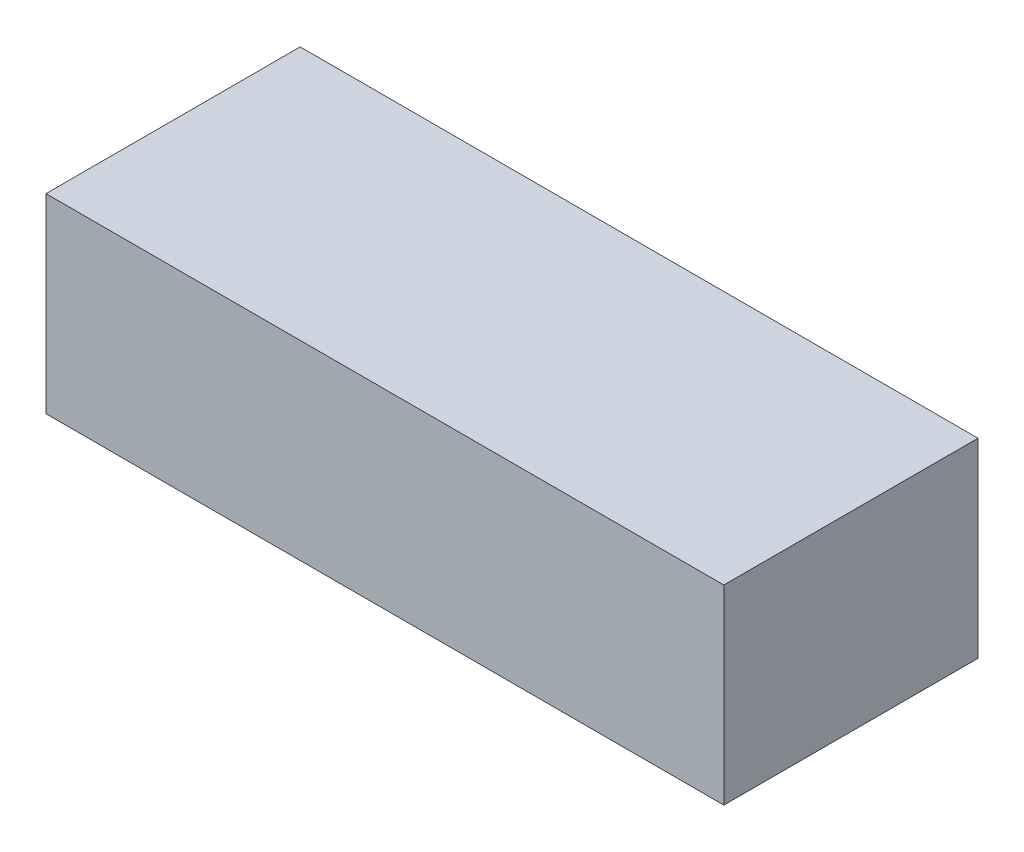
ISO-10303-21;
HEADER;
FILE_DESCRIPTION(('STEP AP214'),'2;1');
FILE_NAME('part.step','',(''),(''),'','','');
FILE_SCHEMA(('AUTOMOTIVE_DESIGN { 1 0 10303 214 1 1 1 1 }'));
ENDSEC;
DATA;
#1=APPLICATION_CONTEXT('core data for automotive mechanical design processes');
#2=APPLICATION_PROTOCOL_DEFINITION('international standard','automotive_design',2000,#1);
#3=PRODUCT_CONTEXT('',#1,'mechanical');
#4=PRODUCT('Part','Part','',(#3));
#5=PRODUCT_RELATED_PRODUCT_CATEGORY('part','',(#4));
#6=PRODUCT_DEFINITION_FORMATION('','',#4);
#7=PRODUCT_DEFINITION_CONTEXT('part definition',#1,'design');
#8=PRODUCT_DEFINITION('design','',#6,#7);
#9=PRODUCT_DEFINITION_SHAPE('','',#8);
#10=(LENGTH_UNIT() NAMED_UNIT(*) SI_UNIT(.MILLI.,.METRE.));
#11=(NAMED_UNIT(*) PLANE_ANGLE_UNIT() SI_UNIT($,.RADIAN.));
#12=(NAMED_UNIT(*) SI_UNIT($,.STERADIAN.) SOLID_ANGLE_UNIT());
#13=UNCERTAINTY_MEASURE_WITH_UNIT(LENGTH_MEASURE(1.E-05),#10,'distance_accuracy_value','');
#14=(GEOMETRIC_REPRESENTATION_CONTEXT(3) GLOBAL_UNCERTAINTY_ASSIGNED_CONTEXT((#13)) GLOBAL_UNIT_ASSIGNED_CONTEXT((#10,
#11,#12)) REPRESENTATION_CONTEXT('',''));
#15=CARTESIAN_POINT('',(0.,0.,0.));
#16=DIRECTION('',(0.,0.,1.));
#17=DIRECTION('',(1.,0.,0.));
#18=AXIS2_PLACEMENT_3D('',#15,#16,#17);
#19=CARTESIAN_POINT('',(0.,45.,60.));
#20=DIRECTION('',(1.,0.,0.));
#21=DIRECTION('',(0.,0.,-1.));
#22=AXIS2_PLACEMENT_3D('',#19,#20,#21);
#23=PLANE('',#22);
#24=DIRECTION('',(0.,0.,1.));
#25=VECTOR('',#24,1.);
#26=CARTESIAN_POINT('',(0.,0.,60.));
#27=LINE('',#26,#25);
#28=CARTESIAN_POINT('',(0.,0.,0.));
#29=VERTEX_POINT('',#28);
#30=CARTESIAN_POINT('',(0.,0.,60.));
#31=VERTEX_POINT('',#30);
#32=EDGE_CURVE('E99',#29,#31,#27,.T.);
#33=ORIENTED_EDGE('',*,*,#32,.T.);
#34=DIRECTION('',(0.,-1.,0.));
#35=VECTOR('',#34,1.);
#36=CARTESIAN_POINT('',(0.,45.,60.));
#37=LINE('',#36,#35);
#38=CARTESIAN_POINT('',(0.,45.,60.));
#39=VERTEX_POINT('',#38);
#40=EDGE_CURVE('E11',#39,#31,#37,.T.);
#41=ORIENTED_EDGE('',*,*,#40,.F.);
#42=DIRECTION('',(0.,0.,1.));
#43=VECTOR('',#42,1.);
#44=CARTESIAN_POINT('',(0.,45.,60.));
#45=LINE('',#44,#43);
#46=CARTESIAN_POINT('',(0.,45.,0.));
#47=VERTEX_POINT('',#46);
#48=EDGE_CURVE('E87',#47,#39,#45,.T.);
#49=ORIENTED_EDGE('',*,*,#48,.F.);
#50=DIRECTION('',(0.,-1.,0.));
#51=VECTOR('',#50,1.);
#52=CARTESIAN_POINT('',(0.,45.,0.));
#53=LINE('',#52,#51);
#54=EDGE_CURVE('E95',#47,#29,#53,.T.);
#55=ORIENTED_EDGE('',*,*,#54,.T.);
#56=EDGE_LOOP('',(#33,#41,#49,#55));
#57=FACE_BOUND('',#56,.T.);
#58=ADVANCED_FACE('F36',(#57),#23,.F.);
#59=CARTESIAN_POINT('',(160.,45.,60.));
#60=DIRECTION('',(0.,0.,-1.));
#61=DIRECTION('',(-1.,0.,0.));
#62=AXIS2_PLACEMENT_3D('',#59,#60,#61);
#63=PLANE('',#62);
#64=DIRECTION('',(1.,0.,0.));
#65=VECTOR('',#64,1.);
#66=CARTESIAN_POINT('',(160.,0.,60.));
#67=LINE('',#66,#65);
#68=CARTESIAN_POINT('',(160.,0.,60.));
#69=VERTEX_POINT('',#68);
#70=EDGE_CURVE('E91',#31,#69,#67,.T.);
#71=ORIENTED_EDGE('',*,*,#70,.T.);
#72=DIRECTION('',(0.,-1.,0.));
#73=VECTOR('',#72,1.);
#74=CARTESIAN_POINT('',(160.,45.,60.));
#75=LINE('',#74,#73);
#76=CARTESIAN_POINT('',(160.,45.,60.));
#77=VERTEX_POINT('',#76);
#78=EDGE_CURVE('E44',#77,#69,#75,.T.);
#79=ORIENTED_EDGE('',*,*,#78,.F.);
#80=DIRECTION('',(1.,0.,0.));
#81=VECTOR('',#80,1.);
#82=CARTESIAN_POINT('',(160.,45.,60.));
#83=LINE('',#82,#81);
#84=EDGE_CURVE('E82',#39,#77,#83,.T.);
#85=ORIENTED_EDGE('',*,*,#84,.F.);
#86=ORIENTED_EDGE('',*,*,#40,.T.);
#87=EDGE_LOOP('',(#71,#79,#85,#86));
#88=FACE_BOUND('',#87,.T.);
#89=ADVANCED_FACE('F90',(#88),#63,.F.);
#90=CARTESIAN_POINT('',(160.,45.,0.));
#91=DIRECTION('',(-1.,0.,0.));
#92=DIRECTION('',(0.,0.,1.));
#93=AXIS2_PLACEMENT_3D('',#90,#91,#92);
#94=PLANE('',#93);
#95=DIRECTION('',(0.,0.,-1.));
#96=VECTOR('',#95,1.);
#97=CARTESIAN_POINT('',(160.,0.,0.));
#98=LINE('',#97,#96);
#99=CARTESIAN_POINT('',(160.,0.,0.));
#100=VERTEX_POINT('',#99);
#101=EDGE_CURVE('E69',#69,#100,#98,.T.);
#102=ORIENTED_EDGE('',*,*,#101,.T.);
#103=DIRECTION('',(0.,-1.,0.));
#104=VECTOR('',#103,1.);
#105=CARTESIAN_POINT('',(160.,45.,0.));
#106=LINE('',#105,#104);
#107=CARTESIAN_POINT('',(160.,45.,0.));
#108=VERTEX_POINT('',#107);
#109=EDGE_CURVE('E92',#108,#100,#106,.T.);
#110=ORIENTED_EDGE('',*,*,#109,.F.);
#111=DIRECTION('',(0.,0.,-1.));
#112=VECTOR('',#111,1.);
#113=CARTESIAN_POINT('',(160.,45.,0.));
#114=LINE('',#113,#112);
#115=EDGE_CURVE('E85',#77,#108,#114,.T.);
#116=ORIENTED_EDGE('',*,*,#115,.F.);
#117=ORIENTED_EDGE('',*,*,#78,.T.);
#118=EDGE_LOOP('',(#102,#110,#116,#117));
#119=FACE_BOUND('',#118,.T.);
#120=ADVANCED_FACE('F93',(#119),#94,.F.);
#121=CARTESIAN_POINT('',(0.,45.,0.));
#122=DIRECTION('',(0.,0.,1.));
#123=DIRECTION('',(1.,0.,0.));
#124=AXIS2_PLACEMENT_3D('',#121,#122,#123);
#125=PLANE('',#124);
#126=DIRECTION('',(-1.,0.,0.));
#127=VECTOR('',#126,1.);
#128=CARTESIAN_POINT('',(0.,0.,0.));
#129=LINE('',#128,#127);
#130=EDGE_CURVE('E75',#100,#29,#129,.T.);
#131=ORIENTED_EDGE('',*,*,#130,.T.);
#132=ORIENTED_EDGE('',*,*,#54,.F.);
#133=DIRECTION('',(-1.,0.,0.));
#134=VECTOR('',#133,1.);
#135=CARTESIAN_POINT('',(0.,45.,0.));
#136=LINE('',#135,#134);
#137=EDGE_CURVE('E52',#108,#47,#136,.T.);
#138=ORIENTED_EDGE('',*,*,#137,.F.);
#139=ORIENTED_EDGE('',*,*,#109,.T.);
#140=EDGE_LOOP('',(#131,#132,#138,#139));
#141=FACE_BOUND('',#140,.T.);
#142=ADVANCED_FACE('F106',(#141),#125,.F.);
#143=CARTESIAN_POINT('',(0.,45.,0.));
#144=DIRECTION('',(0.,-1.,0.));
#145=DIRECTION('',(0.,0.,-1.));
#146=AXIS2_PLACEMENT_3D('',#143,#144,#145);
#147=PLANE('',#146);
#148=ORIENTED_EDGE('',*,*,#48,.T.);
#149=ORIENTED_EDGE('',*,*,#84,.T.);
#150=ORIENTED_EDGE('',*,*,#115,.T.);
#151=ORIENTED_EDGE('',*,*,#137,.T.);
#152=EDGE_LOOP('',(#148,#149,#150,#151));
#153=FACE_BOUND('',#152,.T.);
#154=ADVANCED_FACE('F83',(#153),#147,.F.);
#155=CARTESIAN_POINT('',(0.,0.,0.));
#156=DIRECTION('',(0.,-1.,0.));
#157=DIRECTION('',(0.,0.,-1.));
#158=AXIS2_PLACEMENT_3D('',#155,#156,#157);
#159=PLANE('',#158);
#160=ORIENTED_EDGE('',*,*,#32,.F.);
#161=ORIENTED_EDGE('',*,*,#130,.F.);
#162=ORIENTED_EDGE('',*,*,#101,.F.);
#163=ORIENTED_EDGE('',*,*,#70,.F.);
#164=EDGE_LOOP('',(#160,#161,#162,#163));
#165=FACE_BOUND('',#164,.T.);
#166=ADVANCED_FACE('F109',(#165),#159,.T.);
#167=CLOSED_SHELL('',(#58,#89,#120,#142,#154,#166));
#168=MANIFOLD_SOLID_BREP('B2',#167);
#169=ADVANCED_BREP_SHAPE_REPRESENTATION('',(#18,#168),#14);
#170=SHAPE_DEFINITION_REPRESENTATION(#9,#169);
ENDSEC;
END-ISO-10303-21;
